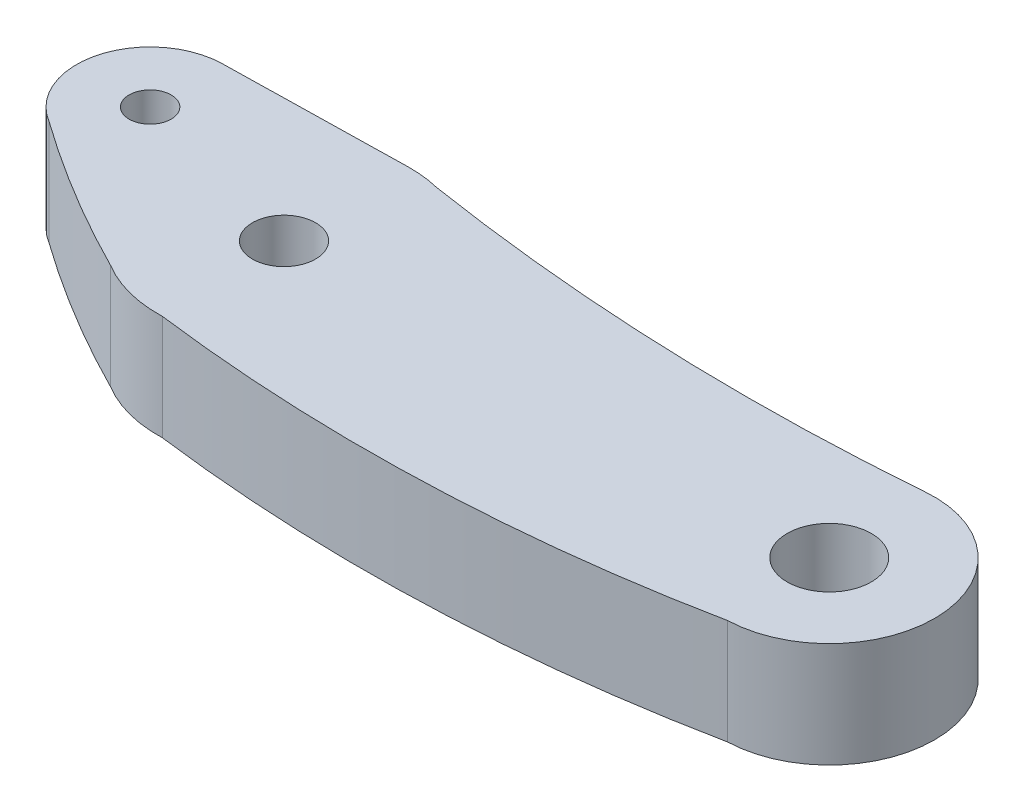
ISO-10303-21;
HEADER;
FILE_DESCRIPTION(('STEP AP214'),'2;1');
FILE_NAME('part.step','',(''),(''),'','','');
FILE_SCHEMA(('AUTOMOTIVE_DESIGN { 1 0 10303 214 1 1 1 1 }'));
ENDSEC;
DATA;
#1=APPLICATION_CONTEXT('core data for automotive mechanical design processes');
#2=APPLICATION_PROTOCOL_DEFINITION('international standard','automotive_design',2000,#1);
#3=PRODUCT_CONTEXT('',#1,'mechanical');
#4=PRODUCT('Part','Part','',(#3));
#5=PRODUCT_RELATED_PRODUCT_CATEGORY('part','',(#4));
#6=PRODUCT_DEFINITION_FORMATION('','',#4);
#7=PRODUCT_DEFINITION_CONTEXT('part definition',#1,'design');
#8=PRODUCT_DEFINITION('design','',#6,#7);
#9=PRODUCT_DEFINITION_SHAPE('','',#8);
#10=(LENGTH_UNIT() NAMED_UNIT(*) SI_UNIT(.MILLI.,.METRE.));
#11=(NAMED_UNIT(*) PLANE_ANGLE_UNIT() SI_UNIT($,.RADIAN.));
#12=(NAMED_UNIT(*) SI_UNIT($,.STERADIAN.) SOLID_ANGLE_UNIT());
#13=UNCERTAINTY_MEASURE_WITH_UNIT(LENGTH_MEASURE(1.E-05),#10,'distance_accuracy_value','');
#14=(GEOMETRIC_REPRESENTATION_CONTEXT(3) GLOBAL_UNCERTAINTY_ASSIGNED_CONTEXT((#13)) GLOBAL_UNIT_ASSIGNED_CONTEXT((#10,
#11,#12)) REPRESENTATION_CONTEXT('',''));
#15=CARTESIAN_POINT('',(0.,0.,0.));
#16=DIRECTION('',(0.,0.,1.));
#17=DIRECTION('',(1.,0.,0.));
#18=AXIS2_PLACEMENT_3D('',#15,#16,#17);
#19=CARTESIAN_POINT('',(22.4029351532236,5.,-45.459714321533));
#20=DIRECTION('',(0.,-1.,0.));
#21=DIRECTION('',(0.,0.,-1.));
#22=AXIS2_PLACEMENT_3D('',#19,#20,#21);
#23=CYLINDRICAL_SURFACE('',#22,56.6605897405053);
#24=CARTESIAN_POINT('',(22.4029351532236,0.,-45.459714321533));
#25=DIRECTION('',(0.,1.,0.));
#26=DIRECTION('',(0.,0.,1.));
#27=AXIS2_PLACEMENT_3D('',#24,#25,#26);
#28=CIRCLE('',#27,56.6605897405053);
#29=CARTESIAN_POINT('',(-10.5026435908739,0.,0.666691535176163));
#30=VERTEX_POINT('',#29);
#31=CARTESIAN_POINT('',(-3.10167626446679,0.,5.13610789902659));
#32=VERTEX_POINT('',#31);
#33=EDGE_CURVE('E157',#30,#32,#28,.T.);
#34=ORIENTED_EDGE('',*,*,#33,.T.);
#35=DIRECTION('',(0.,-1.,0.));
#36=VECTOR('',#35,1.);
#37=CARTESIAN_POINT('',(-3.10167626446679,5.,5.13610789902659));
#38=LINE('',#37,#36);
#39=CARTESIAN_POINT('',(-3.10167626446679,5.,5.13610789902659));
#40=VERTEX_POINT('',#39);
#41=EDGE_CURVE('E11',#40,#32,#38,.T.);
#42=ORIENTED_EDGE('',*,*,#41,.F.);
#43=CARTESIAN_POINT('',(22.4029351532236,5.,-45.459714321533));
#44=DIRECTION('',(0.,1.,0.));
#45=DIRECTION('',(0.,0.,1.));
#46=AXIS2_PLACEMENT_3D('',#43,#44,#45);
#47=CIRCLE('',#46,56.6605897405053);
#48=CARTESIAN_POINT('',(-10.5026435908739,5.,0.666691535176163));
#49=VERTEX_POINT('',#48);
#50=EDGE_CURVE('E221',#49,#40,#47,.T.);
#51=ORIENTED_EDGE('',*,*,#50,.F.);
#52=DIRECTION('',(0.,-1.,0.));
#53=VECTOR('',#52,1.);
#54=CARTESIAN_POINT('',(-10.5026435908739,5.,0.666691535176163));
#55=LINE('',#54,#53);
#56=EDGE_CURVE('E141',#49,#30,#55,.T.);
#57=ORIENTED_EDGE('',*,*,#56,.T.);
#58=EDGE_LOOP('',(#34,#42,#51,#57));
#59=FACE_BOUND('',#58,.T.);
#60=ADVANCED_FACE('F45',(#59),#23,.T.);
#61=CARTESIAN_POINT('',(0.,5.,0.));
#62=DIRECTION('',(0.,-1.,0.));
#63=DIRECTION('',(0.,0.,-1.));
#64=AXIS2_PLACEMENT_3D('',#61,#62,#63);
#65=CYLINDRICAL_SURFACE('',#64,6.);
#66=CARTESIAN_POINT('',(0.,0.,0.));
#67=DIRECTION('',(0.,1.,0.));
#68=DIRECTION('',(0.,0.,1.));
#69=AXIS2_PLACEMENT_3D('',#66,#67,#68);
#70=CIRCLE('',#69,6.);
#71=CARTESIAN_POINT('',(0.210435346596319,0.,5.99630861154618));
#72=VERTEX_POINT('',#71);
#73=EDGE_CURVE('E161',#32,#72,#70,.T.);
#74=ORIENTED_EDGE('',*,*,#73,.T.);
#75=DIRECTION('',(0.,-1.,0.));
#76=VECTOR('',#75,1.);
#77=CARTESIAN_POINT('',(0.210435346596319,5.,5.99630861154618));
#78=LINE('',#77,#76);
#79=CARTESIAN_POINT('',(0.210435346596319,5.,5.99630861154618));
#80=VERTEX_POINT('',#79);
#81=EDGE_CURVE('E55',#80,#72,#78,.T.);
#82=ORIENTED_EDGE('',*,*,#81,.F.);
#83=CARTESIAN_POINT('',(0.,5.,0.));
#84=DIRECTION('',(0.,1.,0.));
#85=DIRECTION('',(0.,0.,1.));
#86=AXIS2_PLACEMENT_3D('',#83,#84,#85);
#87=CIRCLE('',#86,6.);
#88=EDGE_CURVE('E102',#40,#80,#87,.T.);
#89=ORIENTED_EDGE('',*,*,#88,.F.);
#90=ORIENTED_EDGE('',*,*,#41,.T.);
#91=EDGE_LOOP('',(#74,#82,#89,#90));
#92=FACE_BOUND('',#91,.T.);
#93=ADVANCED_FACE('F261',(#92),#65,.T.);
#94=CARTESIAN_POINT('',(10.4244379220939,5.,-73.3489757561321));
#95=DIRECTION('',(0.,-1.,0.));
#96=DIRECTION('',(0.,0.,-1.));
#97=AXIS2_PLACEMENT_3D('',#94,#95,#96);
#98=CYLINDRICAL_SURFACE('',#97,80.);
#99=CARTESIAN_POINT('',(10.4244379220939,0.,-73.3489757561321));
#100=DIRECTION('',(0.,1.,0.));
#101=DIRECTION('',(0.,0.,1.));
#102=AXIS2_PLACEMENT_3D('',#99,#100,#101);
#103=CIRCLE('',#102,80.);
#104=CARTESIAN_POINT('',(26.1755722842109,0.,5.08508423253953));
#105=VERTEX_POINT('',#104);
#106=EDGE_CURVE('E164',#72,#105,#103,.T.);
#107=ORIENTED_EDGE('',*,*,#106,.T.);
#108=DIRECTION('',(0.,-1.,0.));
#109=VECTOR('',#108,1.);
#110=CARTESIAN_POINT('',(26.1755722842109,5.,5.08508423253953));
#111=LINE('',#110,#109);
#112=CARTESIAN_POINT('',(26.1755722842109,5.,5.08508423253953));
#113=VERTEX_POINT('',#112);
#114=EDGE_CURVE('E192',#113,#105,#111,.T.);
#115=ORIENTED_EDGE('',*,*,#114,.F.);
#116=CARTESIAN_POINT('',(10.4244379220939,5.,-73.3489757561321));
#117=DIRECTION('',(0.,1.,0.));
#118=DIRECTION('',(0.,0.,1.));
#119=AXIS2_PLACEMENT_3D('',#116,#117,#118);
#120=CIRCLE('',#119,80.);
#121=EDGE_CURVE('E202',#80,#113,#120,.T.);
#122=ORIENTED_EDGE('',*,*,#121,.F.);
#123=ORIENTED_EDGE('',*,*,#81,.T.);
#124=EDGE_LOOP('',(#107,#115,#122,#123));
#125=FACE_BOUND('',#124,.T.);
#126=ADVANCED_FACE('F200',(#125),#98,.T.);
#127=CARTESIAN_POINT('',(26.,5.,0.0821908650961338));
#128=DIRECTION('',(0.,-1.,0.));
#129=DIRECTION('',(0.,0.,-1.));
#130=AXIS2_PLACEMENT_3D('',#127,#128,#129);
#131=CYLINDRICAL_SURFACE('',#130,5.00597319938812);
#132=CARTESIAN_POINT('',(26.,0.,0.0821908650961338));
#133=DIRECTION('',(0.,1.,0.));
#134=DIRECTION('',(0.,0.,1.));
#135=AXIS2_PLACEMENT_3D('',#132,#133,#134);
#136=CIRCLE('',#135,5.00597319938812);
#137=CARTESIAN_POINT('',(25.5399399672504,0.,-4.90259723865096));
#138=VERTEX_POINT('',#137);
#139=EDGE_CURVE('E167',#105,#138,#136,.T.);
#140=ORIENTED_EDGE('',*,*,#139,.T.);
#141=DIRECTION('',(0.,-1.,0.));
#142=VECTOR('',#141,1.);
#143=CARTESIAN_POINT('',(25.5399399672504,5.,-4.90259723865096));
#144=LINE('',#143,#142);
#145=CARTESIAN_POINT('',(25.5399399672504,5.,-4.90259723865096));
#146=VERTEX_POINT('',#145);
#147=EDGE_CURVE('E189',#146,#138,#144,.T.);
#148=ORIENTED_EDGE('',*,*,#147,.F.);
#149=CARTESIAN_POINT('',(26.,5.,0.0821908650961338));
#150=DIRECTION('',(0.,1.,0.));
#151=DIRECTION('',(0.,0.,1.));
#152=AXIS2_PLACEMENT_3D('',#149,#150,#151);
#153=CIRCLE('',#152,5.00597319938812);
#154=EDGE_CURVE('E212',#113,#146,#153,.T.);
#155=ORIENTED_EDGE('',*,*,#154,.F.);
#156=ORIENTED_EDGE('',*,*,#114,.T.);
#157=EDGE_LOOP('',(#140,#148,#155,#156));
#158=FACE_BOUND('',#157,.T.);
#159=ADVANCED_FACE('F210',(#158),#131,.T.);
#160=CARTESIAN_POINT('',(17.3651738925711,5.,-106.574487157272));
#161=DIRECTION('',(0.,-1.,0.));
#162=DIRECTION('',(0.,0.,-1.));
#163=AXIS2_PLACEMENT_3D('',#160,#161,#162);
#164=CYLINDRICAL_SURFACE('',#163,102.);
#165=CARTESIAN_POINT('',(17.3651738925711,0.,-106.574487157272));
#166=DIRECTION('',(0.,1.,0.));
#167=DIRECTION('',(0.,0.,1.));
#168=AXIS2_PLACEMENT_3D('',#165,#166,#167);
#169=CIRCLE('',#168,102.);
#170=CARTESIAN_POINT('',(1.43194777922786,0.,-5.82662213959035));
#171=VERTEX_POINT('',#170);
#172=EDGE_CURVE('E171',#171,#138,#169,.T.);
#173=ORIENTED_EDGE('',*,*,#172,.F.);
#174=DIRECTION('',(0.,-1.,0.));
#175=VECTOR('',#174,1.);
#176=CARTESIAN_POINT('',(1.43194777922786,5.,-5.82662213959035));
#177=LINE('',#176,#175);
#178=CARTESIAN_POINT('',(1.43194777922786,5.,-5.82662213959035));
#179=VERTEX_POINT('',#178);
#180=EDGE_CURVE('E135',#179,#171,#177,.T.);
#181=ORIENTED_EDGE('',*,*,#180,.F.);
#182=CARTESIAN_POINT('',(17.3651738925711,5.,-106.574487157272));
#183=DIRECTION('',(0.,1.,0.));
#184=DIRECTION('',(0.,0.,1.));
#185=AXIS2_PLACEMENT_3D('',#182,#183,#184);
#186=CIRCLE('',#185,102.);
#187=EDGE_CURVE('E122',#179,#146,#186,.T.);
#188=ORIENTED_EDGE('',*,*,#187,.T.);
#189=ORIENTED_EDGE('',*,*,#147,.T.);
#190=EDGE_LOOP('',(#173,#181,#188,#189));
#191=FACE_BOUND('',#190,.T.);
#192=ADVANCED_FACE('F286',(#191),#164,.F.);
#193=CARTESIAN_POINT('',(0.,5.,0.));
#194=DIRECTION('',(0.,-1.,0.));
#195=DIRECTION('',(0.,0.,-1.));
#196=AXIS2_PLACEMENT_3D('',#193,#194,#195);
#197=CYLINDRICAL_SURFACE('',#196,6.);
#198=CARTESIAN_POINT('',(0.,0.,0.));
#199=DIRECTION('',(0.,1.,0.));
#200=DIRECTION('',(0.,0.,1.));
#201=AXIS2_PLACEMENT_3D('',#198,#199,#200);
#202=CIRCLE('',#201,6.);
#203=CARTESIAN_POINT('',(-0.118076489830129,0.,-5.99883804936834));
#204=VERTEX_POINT('',#203);
#205=EDGE_CURVE('E130',#171,#204,#202,.T.);
#206=ORIENTED_EDGE('',*,*,#205,.T.);
#207=DIRECTION('',(0.,-1.,0.));
#208=VECTOR('',#207,1.);
#209=CARTESIAN_POINT('',(-0.118076489830129,5.,-5.99883804936834));
#210=LINE('',#209,#208);
#211=CARTESIAN_POINT('',(-0.118076489830129,5.,-5.99883804936834));
#212=VERTEX_POINT('',#211);
#213=EDGE_CURVE('E127',#212,#204,#210,.T.);
#214=ORIENTED_EDGE('',*,*,#213,.F.);
#215=CARTESIAN_POINT('',(0.,5.,0.));
#216=DIRECTION('',(0.,1.,0.));
#217=DIRECTION('',(0.,0.,1.));
#218=AXIS2_PLACEMENT_3D('',#215,#216,#217);
#219=CIRCLE('',#218,6.);
#220=EDGE_CURVE('E116',#179,#212,#219,.T.);
#221=ORIENTED_EDGE('',*,*,#220,.F.);
#222=ORIENTED_EDGE('',*,*,#180,.T.);
#223=EDGE_LOOP('',(#206,#214,#221,#222));
#224=FACE_BOUND('',#223,.T.);
#225=ADVANCED_FACE('F128',(#224),#197,.T.);
#226=CARTESIAN_POINT('',(-0.118076489830128,5.,-5.99883804936834));
#227=DIRECTION('',(-0.0196794149716879,0.,-0.999806341561391));
#228=DIRECTION('',(-0.999806341561391,0.,0.0196794149716879));
#229=AXIS2_PLACEMENT_3D('',#226,#227,#228);
#230=PLANE('',#229);
#231=DIRECTION('',(0.999806341561391,0.,-0.0196794149716879));
#232=VECTOR('',#231,1.);
#233=CARTESIAN_POINT('',(-0.118076489830128,0.,-5.99883804936834));
#234=LINE('',#233,#232);
#235=CARTESIAN_POINT('',(-8.76221038900252,0.,-5.82869360138756));
#236=VERTEX_POINT('',#235);
#237=EDGE_CURVE('E177',#236,#204,#234,.T.);
#238=ORIENTED_EDGE('',*,*,#237,.F.);
#239=DIRECTION('',(0.,-1.,0.));
#240=VECTOR('',#239,1.);
#241=CARTESIAN_POINT('',(-8.76221038900252,5.,-5.82869360138756));
#242=LINE('',#241,#240);
#243=CARTESIAN_POINT('',(-8.76221038900252,5.,-5.82869360138756));
#244=VERTEX_POINT('',#243);
#245=EDGE_CURVE('E91',#244,#236,#242,.T.);
#246=ORIENTED_EDGE('',*,*,#245,.F.);
#247=DIRECTION('',(0.999806341561391,0.,-0.0196794149716879));
#248=VECTOR('',#247,1.);
#249=CARTESIAN_POINT('',(-0.118076489830128,5.,-5.99883804936834));
#250=LINE('',#249,#248);
#251=EDGE_CURVE('E120',#244,#212,#250,.T.);
#252=ORIENTED_EDGE('',*,*,#251,.T.);
#253=ORIENTED_EDGE('',*,*,#213,.T.);
#254=EDGE_LOOP('',(#238,#246,#252,#253));
#255=FACE_BOUND('',#254,.T.);
#256=ADVANCED_FACE('F137',(#255),#230,.T.);
#257=CARTESIAN_POINT('',(-8.69333243660161,5.,-2.32937140592269));
#258=DIRECTION('',(0.,-1.,0.));
#259=DIRECTION('',(0.,0.,-1.));
#260=AXIS2_PLACEMENT_3D('',#257,#258,#259);
#261=CYLINDRICAL_SURFACE('',#260,1.);
#262=CARTESIAN_POINT('',(-8.69333243660161,5.,-2.32937140592269));
#263=DIRECTION('',(0.,1.,0.));
#264=DIRECTION('',(0.,0.,1.));
#265=AXIS2_PLACEMENT_3D('',#262,#263,#264);
#266=CIRCLE('',#265,1.);
#267=CARTESIAN_POINT('',(-8.69333243660161,5.,-1.32937140592269));
#268=VERTEX_POINT('',#267);
#269=EDGE_CURVE('E224',#268,#268,#266,.T.);
#270=ORIENTED_EDGE('',*,*,#269,.T.);
#271=EDGE_LOOP('',(#270));
#272=FACE_BOUND('',#271,.T.);
#273=CARTESIAN_POINT('',(-8.69333243660161,0.,-2.32937140592269));
#274=DIRECTION('',(0.,1.,0.));
#275=DIRECTION('',(0.,0.,1.));
#276=AXIS2_PLACEMENT_3D('',#273,#274,#275);
#277=CIRCLE('',#276,1.);
#278=CARTESIAN_POINT('',(-8.69333243660161,0.,-1.32937140592269));
#279=VERTEX_POINT('',#278);
#280=EDGE_CURVE('E153',#279,#279,#277,.T.);
#281=ORIENTED_EDGE('',*,*,#280,.F.);
#282=EDGE_LOOP('',(#281));
#283=FACE_BOUND('',#282,.T.);
#284=ADVANCED_FACE('F246',(#272,#283),#261,.F.);
#285=CARTESIAN_POINT('',(26.,5.,0.0821908650961338));
#286=DIRECTION('',(0.,-1.,0.));
#287=DIRECTION('',(0.,0.,-1.));
#288=AXIS2_PLACEMENT_3D('',#285,#286,#287);
#289=CYLINDRICAL_SURFACE('',#288,1.99999999999999);
#290=CARTESIAN_POINT('',(26.,5.,0.0821908650961338));
#291=DIRECTION('',(0.,1.,0.));
#292=DIRECTION('',(0.,0.,1.));
#293=AXIS2_PLACEMENT_3D('',#290,#291,#292);
#294=CIRCLE('',#293,1.99999999999999);
#295=CARTESIAN_POINT('',(26.,5.,2.08219086509612));
#296=VERTEX_POINT('',#295);
#297=EDGE_CURVE('E228',#296,#296,#294,.T.);
#298=ORIENTED_EDGE('',*,*,#297,.T.);
#299=EDGE_LOOP('',(#298));
#300=FACE_BOUND('',#299,.T.);
#301=CARTESIAN_POINT('',(26.,0.,0.0821908650961338));
#302=DIRECTION('',(0.,1.,0.));
#303=DIRECTION('',(0.,0.,1.));
#304=AXIS2_PLACEMENT_3D('',#301,#302,#303);
#305=CIRCLE('',#304,1.99999999999999);
#306=CARTESIAN_POINT('',(26.,0.,2.08219086509612));
#307=VERTEX_POINT('',#306);
#308=EDGE_CURVE('E149',#307,#307,#305,.T.);
#309=ORIENTED_EDGE('',*,*,#308,.F.);
#310=EDGE_LOOP('',(#309));
#311=FACE_BOUND('',#310,.T.);
#312=ADVANCED_FACE('F249',(#300,#311),#289,.F.);
#313=CARTESIAN_POINT('',(0.,5.,0.));
#314=DIRECTION('',(0.,-1.,0.));
#315=DIRECTION('',(0.,0.,-1.));
#316=AXIS2_PLACEMENT_3D('',#313,#314,#315);
#317=CYLINDRICAL_SURFACE('',#316,1.5);
#318=CARTESIAN_POINT('',(0.,5.,0.));
#319=DIRECTION('',(0.,1.,0.));
#320=DIRECTION('',(0.,0.,1.));
#321=AXIS2_PLACEMENT_3D('',#318,#319,#320);
#322=CIRCLE('',#321,1.5);
#323=CARTESIAN_POINT('',(0.,5.,1.5));
#324=VERTEX_POINT('',#323);
#325=EDGE_CURVE('E182',#324,#324,#322,.T.);
#326=ORIENTED_EDGE('',*,*,#325,.T.);
#327=EDGE_LOOP('',(#326));
#328=FACE_BOUND('',#327,.T.);
#329=CARTESIAN_POINT('',(0.,0.,0.));
#330=DIRECTION('',(0.,1.,0.));
#331=DIRECTION('',(0.,0.,1.));
#332=AXIS2_PLACEMENT_3D('',#329,#330,#331);
#333=CIRCLE('',#332,1.5);
#334=CARTESIAN_POINT('',(0.,0.,1.5));
#335=VERTEX_POINT('',#334);
#336=EDGE_CURVE('E145',#335,#335,#333,.T.);
#337=ORIENTED_EDGE('',*,*,#336,.F.);
#338=EDGE_LOOP('',(#337));
#339=FACE_BOUND('',#338,.T.);
#340=ADVANCED_FACE('F47',(#328,#339),#317,.F.);
#341=CARTESIAN_POINT('',(-8.69333243660161,5.,-2.32937140592269));
#342=DIRECTION('',(0.,-1.,0.));
#343=DIRECTION('',(0.,0.,-1.));
#344=AXIS2_PLACEMENT_3D('',#341,#342,#343);
#345=CYLINDRICAL_SURFACE('',#344,3.5);
#346=CARTESIAN_POINT('',(-8.69333243660161,0.,-2.32937140592269));
#347=DIRECTION('',(0.,1.,0.));
#348=DIRECTION('',(0.,0.,1.));
#349=AXIS2_PLACEMENT_3D('',#346,#347,#348);
#350=CIRCLE('',#349,3.5);
#351=EDGE_CURVE('E94',#236,#30,#350,.T.);
#352=ORIENTED_EDGE('',*,*,#351,.T.);
#353=ORIENTED_EDGE('',*,*,#56,.F.);
#354=CARTESIAN_POINT('',(-8.69333243660161,5.,-2.32937140592269));
#355=DIRECTION('',(0.,1.,0.));
#356=DIRECTION('',(0.,0.,1.));
#357=AXIS2_PLACEMENT_3D('',#354,#355,#356);
#358=CIRCLE('',#357,3.5);
#359=EDGE_CURVE('E63',#244,#49,#358,.T.);
#360=ORIENTED_EDGE('',*,*,#359,.F.);
#361=ORIENTED_EDGE('',*,*,#245,.T.);
#362=EDGE_LOOP('',(#352,#353,#360,#361));
#363=FACE_BOUND('',#362,.T.);
#364=ADVANCED_FACE('F240',(#363),#345,.T.);
#365=CARTESIAN_POINT('',(0.,5.,0.));
#366=DIRECTION('',(0.,1.,0.));
#367=DIRECTION('',(0.,0.,1.));
#368=AXIS2_PLACEMENT_3D('',#365,#366,#367);
#369=PLANE('',#368);
#370=ORIENTED_EDGE('',*,*,#325,.F.);
#371=EDGE_LOOP('',(#370));
#372=FACE_BOUND('',#371,.T.);
#373=ORIENTED_EDGE('',*,*,#297,.F.);
#374=EDGE_LOOP('',(#373));
#375=FACE_BOUND('',#374,.T.);
#376=ORIENTED_EDGE('',*,*,#269,.F.);
#377=EDGE_LOOP('',(#376));
#378=FACE_BOUND('',#377,.T.);
#379=ORIENTED_EDGE('',*,*,#50,.T.);
#380=ORIENTED_EDGE('',*,*,#88,.T.);
#381=ORIENTED_EDGE('',*,*,#121,.T.);
#382=ORIENTED_EDGE('',*,*,#154,.T.);
#383=ORIENTED_EDGE('',*,*,#187,.F.);
#384=ORIENTED_EDGE('',*,*,#220,.T.);
#385=ORIENTED_EDGE('',*,*,#251,.F.);
#386=ORIENTED_EDGE('',*,*,#359,.T.);
#387=EDGE_LOOP('',(#379,#380,#381,#382,#383,#384,#385,#386));
#388=FACE_BOUND('',#387,.T.);
#389=ADVANCED_FACE('F118',(#372,#375,#378,#388),#369,.T.);
#390=CARTESIAN_POINT('',(0.,0.,0.));
#391=DIRECTION('',(0.,1.,0.));
#392=DIRECTION('',(0.,0.,1.));
#393=AXIS2_PLACEMENT_3D('',#390,#391,#392);
#394=PLANE('',#393);
#395=ORIENTED_EDGE('',*,*,#336,.T.);
#396=EDGE_LOOP('',(#395));
#397=FACE_BOUND('',#396,.T.);
#398=ORIENTED_EDGE('',*,*,#308,.T.);
#399=EDGE_LOOP('',(#398));
#400=FACE_BOUND('',#399,.T.);
#401=ORIENTED_EDGE('',*,*,#280,.T.);
#402=EDGE_LOOP('',(#401));
#403=FACE_BOUND('',#402,.T.);
#404=ORIENTED_EDGE('',*,*,#33,.F.);
#405=ORIENTED_EDGE('',*,*,#351,.F.);
#406=ORIENTED_EDGE('',*,*,#237,.T.);
#407=ORIENTED_EDGE('',*,*,#205,.F.);
#408=ORIENTED_EDGE('',*,*,#172,.T.);
#409=ORIENTED_EDGE('',*,*,#139,.F.);
#410=ORIENTED_EDGE('',*,*,#106,.F.);
#411=ORIENTED_EDGE('',*,*,#73,.F.);
#412=EDGE_LOOP('',(#404,#405,#406,#407,#408,#409,#410,#411));
#413=FACE_BOUND('',#412,.T.);
#414=ADVANCED_FACE('F206',(#397,#400,#403,#413),#394,.F.);
#415=CLOSED_SHELL('',(#60,#93,#126,#159,#192,#225,#256,#284,#312,#340,#364,#389,#414));
#416=MANIFOLD_SOLID_BREP('B2',#415);
#417=ADVANCED_BREP_SHAPE_REPRESENTATION('',(#18,#416),#14);
#418=SHAPE_DEFINITION_REPRESENTATION(#9,#417);
ENDSEC;
END-ISO-10303-21;
